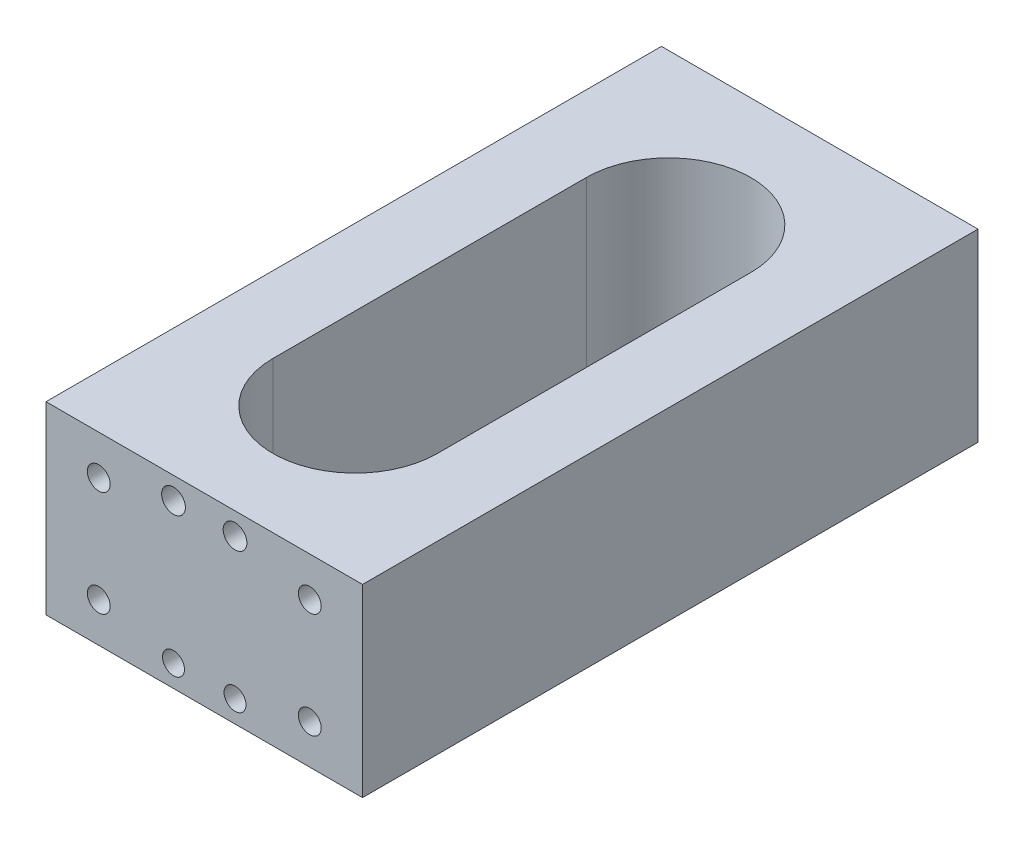
ISO-10303-21;
HEADER;
FILE_DESCRIPTION(('STEP AP214'),'2;1');
FILE_NAME('part.step','',(''),(''),'','','');
FILE_SCHEMA(('AUTOMOTIVE_DESIGN { 1 0 10303 214 1 1 1 1 }'));
ENDSEC;
DATA;
#1=APPLICATION_CONTEXT('core data for automotive mechanical design processes');
#2=APPLICATION_PROTOCOL_DEFINITION('international standard','automotive_design',2000,#1);
#3=PRODUCT_CONTEXT('',#1,'mechanical');
#4=PRODUCT('Part','Part','',(#3));
#5=PRODUCT_RELATED_PRODUCT_CATEGORY('part','',(#4));
#6=PRODUCT_DEFINITION_FORMATION('','',#4);
#7=PRODUCT_DEFINITION_CONTEXT('part definition',#1,'design');
#8=PRODUCT_DEFINITION('design','',#6,#7);
#9=PRODUCT_DEFINITION_SHAPE('','',#8);
#10=(LENGTH_UNIT() NAMED_UNIT(*) SI_UNIT(.MILLI.,.METRE.));
#11=(NAMED_UNIT(*) PLANE_ANGLE_UNIT() SI_UNIT($,.RADIAN.));
#12=(NAMED_UNIT(*) SI_UNIT($,.STERADIAN.) SOLID_ANGLE_UNIT());
#13=UNCERTAINTY_MEASURE_WITH_UNIT(LENGTH_MEASURE(1.E-05),#10,'distance_accuracy_value','');
#14=(GEOMETRIC_REPRESENTATION_CONTEXT(3) GLOBAL_UNCERTAINTY_ASSIGNED_CONTEXT((#13)) GLOBAL_UNIT_ASSIGNED_CONTEXT((#10,
#11,#12)) REPRESENTATION_CONTEXT('',''));
#15=CARTESIAN_POINT('',(0.,0.,0.));
#16=DIRECTION('',(0.,0.,1.));
#17=DIRECTION('',(1.,0.,0.));
#18=AXIS2_PLACEMENT_3D('',#15,#16,#17);
#19=CARTESIAN_POINT('',(0.,0.,0.));
#20=DIRECTION('',(0.,0.,1.));
#21=DIRECTION('',(1.,0.,0.));
#22=AXIS2_PLACEMENT_3D('',#19,#20,#21);
#23=PLANE('',#22);
#24=CARTESIAN_POINT('',(-3.5,-7.99999999999999,0.));
#25=DIRECTION('',(0.,0.,-1.));
#26=DIRECTION('',(-1.,0.,0.));
#27=AXIS2_PLACEMENT_3D('',#24,#25,#26);
#28=CIRCLE('',#27,1.25);
#29=CARTESIAN_POINT('',(-4.75,-7.99999999999999,0.));
#30=VERTEX_POINT('',#29);
#31=EDGE_CURVE('E194',#30,#30,#28,.T.);
#32=ORIENTED_EDGE('',*,*,#31,.F.);
#33=EDGE_LOOP('',(#32));
#34=FACE_BOUND('',#33,.T.);
#35=CARTESIAN_POINT('',(-12.,-5.99999999999999,0.));
#36=DIRECTION('',(0.,0.,1.));
#37=DIRECTION('',(1.,0.,0.));
#38=AXIS2_PLACEMENT_3D('',#35,#36,#37);
#39=CIRCLE('',#38,1.3);
#40=CARTESIAN_POINT('',(-10.7,-5.99999999999999,0.));
#41=VERTEX_POINT('',#40);
#42=EDGE_CURVE('E200',#41,#41,#39,.F.);
#43=ORIENTED_EDGE('',*,*,#42,.F.);
#44=EDGE_LOOP('',(#43));
#45=FACE_BOUND('',#44,.T.);
#46=CARTESIAN_POINT('',(-12.,6.,0.));
#47=DIRECTION('',(0.,0.,1.));
#48=DIRECTION('',(1.,0.,0.));
#49=AXIS2_PLACEMENT_3D('',#46,#47,#48);
#50=CIRCLE('',#49,1.3);
#51=CARTESIAN_POINT('',(-10.7,6.,0.));
#52=VERTEX_POINT('',#51);
#53=EDGE_CURVE('E206',#52,#52,#50,.F.);
#54=ORIENTED_EDGE('',*,*,#53,.F.);
#55=EDGE_LOOP('',(#54));
#56=FACE_BOUND('',#55,.T.);
#57=CARTESIAN_POINT('',(-3.5,8.,0.));
#58=DIRECTION('',(0.,0.,1.));
#59=DIRECTION('',(1.,0.,0.));
#60=AXIS2_PLACEMENT_3D('',#57,#58,#59);
#61=CIRCLE('',#60,1.35000000008995);
#62=CARTESIAN_POINT('',(-2.14999999991005,8.,0.));
#63=VERTEX_POINT('',#62);
#64=EDGE_CURVE('E212',#63,#63,#61,.F.);
#65=ORIENTED_EDGE('',*,*,#64,.F.);
#66=EDGE_LOOP('',(#65));
#67=FACE_BOUND('',#66,.T.);
#68=DIRECTION('',(0.,1.,0.));
#69=VECTOR('',#68,1.);
#70=CARTESIAN_POINT('',(-18.,0.,0.));
#71=LINE('',#70,#69);
#72=CARTESIAN_POINT('',(-18.,-10.5,0.));
#73=VERTEX_POINT('',#72);
#74=CARTESIAN_POINT('',(-18.,10.5,0.));
#75=VERTEX_POINT('',#74);
#76=EDGE_CURVE('E227',#73,#75,#71,.T.);
#77=ORIENTED_EDGE('',*,*,#76,.T.);
#78=DIRECTION('',(-1.,0.,0.));
#79=VECTOR('',#78,1.);
#80=CARTESIAN_POINT('',(0.,10.5,0.));
#81=LINE('',#80,#79);
#82=CARTESIAN_POINT('',(18.,10.5,0.));
#83=VERTEX_POINT('',#82);
#84=EDGE_CURVE('E234',#83,#75,#81,.T.);
#85=ORIENTED_EDGE('',*,*,#84,.F.);
#86=DIRECTION('',(0.,1.,0.));
#87=VECTOR('',#86,1.);
#88=CARTESIAN_POINT('',(18.,0.,0.));
#89=LINE('',#88,#87);
#90=CARTESIAN_POINT('',(18.,-10.5,0.));
#91=VERTEX_POINT('',#90);
#92=EDGE_CURVE('E247',#91,#83,#89,.T.);
#93=ORIENTED_EDGE('',*,*,#92,.F.);
#94=DIRECTION('',(-1.,0.,0.));
#95=VECTOR('',#94,1.);
#96=CARTESIAN_POINT('',(0.,-10.5,0.));
#97=LINE('',#96,#95);
#98=EDGE_CURVE('E244',#91,#73,#97,.T.);
#99=ORIENTED_EDGE('',*,*,#98,.T.);
#100=EDGE_LOOP('',(#77,#85,#93,#99));
#101=FACE_BOUND('',#100,.T.);
#102=CARTESIAN_POINT('',(12.,6.,0.));
#103=DIRECTION('',(0.,0.,1.));
#104=DIRECTION('',(1.,0.,0.));
#105=AXIS2_PLACEMENT_3D('',#102,#103,#104);
#106=CIRCLE('',#105,1.3);
#107=CARTESIAN_POINT('',(13.3,6.,0.));
#108=VERTEX_POINT('',#107);
#109=EDGE_CURVE('E221',#108,#108,#106,.T.);
#110=ORIENTED_EDGE('',*,*,#109,.T.);
#111=EDGE_LOOP('',(#110));
#112=FACE_BOUND('',#111,.T.);
#113=CARTESIAN_POINT('',(3.5,8.,0.));
#114=DIRECTION('',(0.,0.,1.));
#115=DIRECTION('',(1.,0.,0.));
#116=AXIS2_PLACEMENT_3D('',#113,#114,#115);
#117=CIRCLE('',#116,1.35000000008995);
#118=CARTESIAN_POINT('',(4.85000000008995,8.,0.));
#119=VERTEX_POINT('',#118);
#120=EDGE_CURVE('E218',#119,#119,#117,.T.);
#121=ORIENTED_EDGE('',*,*,#120,.T.);
#122=EDGE_LOOP('',(#121));
#123=FACE_BOUND('',#122,.T.);
#124=CARTESIAN_POINT('',(3.5,-8.,0.));
#125=DIRECTION('',(0.,0.,1.));
#126=DIRECTION('',(1.,0.,0.));
#127=AXIS2_PLACEMENT_3D('',#124,#125,#126);
#128=CIRCLE('',#127,1.25);
#129=CARTESIAN_POINT('',(4.75,-8.,0.));
#130=VERTEX_POINT('',#129);
#131=EDGE_CURVE('E188',#130,#130,#128,.T.);
#132=ORIENTED_EDGE('',*,*,#131,.T.);
#133=EDGE_LOOP('',(#132));
#134=FACE_BOUND('',#133,.T.);
#135=CARTESIAN_POINT('',(12.,-6.,0.));
#136=DIRECTION('',(0.,0.,1.));
#137=DIRECTION('',(1.,0.,0.));
#138=AXIS2_PLACEMENT_3D('',#135,#136,#137);
#139=CIRCLE('',#138,1.3);
#140=CARTESIAN_POINT('',(13.3,-6.,0.));
#141=VERTEX_POINT('',#140);
#142=EDGE_CURVE('E182',#141,#141,#139,.T.);
#143=ORIENTED_EDGE('',*,*,#142,.T.);
#144=EDGE_LOOP('',(#143));
#145=FACE_BOUND('',#144,.T.);
#146=ADVANCED_FACE('F34',(#34,#45,#56,#67,#101,#112,#123,#134,#145),#23,.F.);
#147=CARTESIAN_POINT('',(-18.,0.,70.));
#148=DIRECTION('',(-1.,0.,0.));
#149=DIRECTION('',(0.,0.,1.));
#150=AXIS2_PLACEMENT_3D('',#147,#148,#149);
#151=PLANE('',#150);
#152=ORIENTED_EDGE('',*,*,#76,.F.);
#153=DIRECTION('',(0.,0.,-1.));
#154=VECTOR('',#153,1.);
#155=CARTESIAN_POINT('',(-18.,-10.5,70.));
#156=LINE('',#155,#154);
#157=CARTESIAN_POINT('',(-18.,-10.5,70.));
#158=VERTEX_POINT('',#157);
#159=EDGE_CURVE('E11',#158,#73,#156,.T.);
#160=ORIENTED_EDGE('',*,*,#159,.F.);
#161=DIRECTION('',(0.,1.,0.));
#162=VECTOR('',#161,1.);
#163=CARTESIAN_POINT('',(-18.,0.,70.));
#164=LINE('',#163,#162);
#165=CARTESIAN_POINT('',(-18.,10.5,70.));
#166=VERTEX_POINT('',#165);
#167=EDGE_CURVE('E230',#158,#166,#164,.T.);
#168=ORIENTED_EDGE('',*,*,#167,.T.);
#169=DIRECTION('',(0.,0.,-1.));
#170=VECTOR('',#169,1.);
#171=CARTESIAN_POINT('',(-18.,10.5,70.));
#172=LINE('',#171,#170);
#173=EDGE_CURVE('E241',#166,#75,#172,.T.);
#174=ORIENTED_EDGE('',*,*,#173,.T.);
#175=EDGE_LOOP('',(#152,#160,#168,#174));
#176=FACE_BOUND('',#175,.T.);
#177=ADVANCED_FACE('F36',(#176),#151,.T.);
#178=CARTESIAN_POINT('',(0.,-10.5,70.));
#179=DIRECTION('',(0.,-1.,0.));
#180=DIRECTION('',(0.,0.,-1.));
#181=AXIS2_PLACEMENT_3D('',#178,#179,#180);
#182=PLANE('',#181);
#183=CARTESIAN_POINT('',(0.,-10.5,17.1932684601259));
#184=DIRECTION('',(0.,-1.,0.));
#185=DIRECTION('',(0.,0.,-1.));
#186=AXIS2_PLACEMENT_3D('',#183,#184,#185);
#187=CIRCLE('',#186,9.35706048924345);
#188=CARTESIAN_POINT('',(-9.35706048924346,-10.5,17.1932684601259));
#189=VERTEX_POINT('',#188);
#190=CARTESIAN_POINT('',(9.35706048924344,-10.5,17.1932684601259));
#191=VERTEX_POINT('',#190);
#192=EDGE_CURVE('E131',#189,#191,#187,.T.);
#193=ORIENTED_EDGE('',*,*,#192,.F.);
#194=DIRECTION('',(0.,0.,-1.));
#195=VECTOR('',#194,1.);
#196=CARTESIAN_POINT('',(-9.35706048924346,-10.5,70.));
#197=LINE('',#196,#195);
#198=CARTESIAN_POINT('',(-9.35706048924346,-10.5,52.8416943390084));
#199=VERTEX_POINT('',#198);
#200=EDGE_CURVE('E124',#199,#189,#197,.T.);
#201=ORIENTED_EDGE('',*,*,#200,.F.);
#202=CARTESIAN_POINT('',(0.,-10.5,52.8416943390084));
#203=DIRECTION('',(0.,-1.,0.));
#204=DIRECTION('',(0.,0.,-1.));
#205=AXIS2_PLACEMENT_3D('',#202,#203,#204);
#206=CIRCLE('',#205,9.35706048924345);
#207=CARTESIAN_POINT('',(9.35706048924344,-10.5,52.8416943390084));
#208=VERTEX_POINT('',#207);
#209=EDGE_CURVE('E104',#208,#199,#206,.T.);
#210=ORIENTED_EDGE('',*,*,#209,.F.);
#211=DIRECTION('',(0.,0.,1.));
#212=VECTOR('',#211,1.);
#213=CARTESIAN_POINT('',(9.35706048924344,-10.5,70.));
#214=LINE('',#213,#212);
#215=EDGE_CURVE('E129',#191,#208,#214,.T.);
#216=ORIENTED_EDGE('',*,*,#215,.F.);
#217=EDGE_LOOP('',(#193,#201,#210,#216));
#218=FACE_BOUND('',#217,.T.);
#219=ORIENTED_EDGE('',*,*,#98,.F.);
#220=DIRECTION('',(0.,0.,-1.));
#221=VECTOR('',#220,1.);
#222=CARTESIAN_POINT('',(18.,-10.5,70.));
#223=LINE('',#222,#221);
#224=CARTESIAN_POINT('',(18.,-10.5,70.));
#225=VERTEX_POINT('',#224);
#226=EDGE_CURVE('E42',#225,#91,#223,.T.);
#227=ORIENTED_EDGE('',*,*,#226,.F.);
#228=DIRECTION('',(-1.,0.,0.));
#229=VECTOR('',#228,1.);
#230=CARTESIAN_POINT('',(0.,-10.5,70.));
#231=LINE('',#230,#229);
#232=EDGE_CURVE('E233',#225,#158,#231,.T.);
#233=ORIENTED_EDGE('',*,*,#232,.T.);
#234=ORIENTED_EDGE('',*,*,#159,.T.);
#235=EDGE_LOOP('',(#219,#227,#233,#234));
#236=FACE_BOUND('',#235,.T.);
#237=ADVANCED_FACE('F265',(#218,#236),#182,.T.);
#238=CARTESIAN_POINT('',(18.,0.,70.));
#239=DIRECTION('',(-1.,0.,0.));
#240=DIRECTION('',(0.,0.,1.));
#241=AXIS2_PLACEMENT_3D('',#238,#239,#240);
#242=PLANE('',#241);
#243=ORIENTED_EDGE('',*,*,#92,.T.);
#244=DIRECTION('',(0.,0.,-1.));
#245=VECTOR('',#244,1.);
#246=CARTESIAN_POINT('',(18.,10.5,70.));
#247=LINE('',#246,#245);
#248=CARTESIAN_POINT('',(18.,10.5,70.));
#249=VERTEX_POINT('',#248);
#250=EDGE_CURVE('E252',#249,#83,#247,.T.);
#251=ORIENTED_EDGE('',*,*,#250,.F.);
#252=DIRECTION('',(0.,1.,0.));
#253=VECTOR('',#252,1.);
#254=CARTESIAN_POINT('',(18.,0.,70.));
#255=LINE('',#254,#253);
#256=EDGE_CURVE('E237',#225,#249,#255,.T.);
#257=ORIENTED_EDGE('',*,*,#256,.F.);
#258=ORIENTED_EDGE('',*,*,#226,.T.);
#259=EDGE_LOOP('',(#243,#251,#257,#258));
#260=FACE_BOUND('',#259,.T.);
#261=ADVANCED_FACE('F257',(#260),#242,.F.);
#262=CARTESIAN_POINT('',(0.,10.5,70.));
#263=DIRECTION('',(0.,-1.,0.));
#264=DIRECTION('',(0.,0.,-1.));
#265=AXIS2_PLACEMENT_3D('',#262,#263,#264);
#266=PLANE('',#265);
#267=DIRECTION('',(0.,0.,1.));
#268=VECTOR('',#267,1.);
#269=CARTESIAN_POINT('',(-9.35706048924346,10.5,17.1932684601259));
#270=LINE('',#269,#268);
#271=CARTESIAN_POINT('',(-9.35706048924346,10.5,17.1932684601259));
#272=VERTEX_POINT('',#271);
#273=CARTESIAN_POINT('',(-9.35706048924346,10.5,52.8416943390084));
#274=VERTEX_POINT('',#273);
#275=EDGE_CURVE('E110',#272,#274,#270,.T.);
#276=ORIENTED_EDGE('',*,*,#275,.F.);
#277=CARTESIAN_POINT('',(0.,10.5,17.1932684601259));
#278=DIRECTION('',(0.,1.,0.));
#279=DIRECTION('',(0.,0.,1.));
#280=AXIS2_PLACEMENT_3D('',#277,#278,#279);
#281=CIRCLE('',#280,9.35706048924345);
#282=CARTESIAN_POINT('',(9.35706048924344,10.5,17.1932684601259));
#283=VERTEX_POINT('',#282);
#284=EDGE_CURVE('E57',#283,#272,#281,.T.);
#285=ORIENTED_EDGE('',*,*,#284,.F.);
#286=DIRECTION('',(0.,0.,-1.));
#287=VECTOR('',#286,1.);
#288=CARTESIAN_POINT('',(9.35706048924344,10.5,17.1932684601259));
#289=LINE('',#288,#287);
#290=CARTESIAN_POINT('',(9.35706048924344,10.5,52.8416943390084));
#291=VERTEX_POINT('',#290);
#292=EDGE_CURVE('E117',#291,#283,#289,.T.);
#293=ORIENTED_EDGE('',*,*,#292,.F.);
#294=CARTESIAN_POINT('',(0.,10.5,52.8416943390084));
#295=DIRECTION('',(0.,1.,0.));
#296=DIRECTION('',(0.,0.,1.));
#297=AXIS2_PLACEMENT_3D('',#294,#295,#296);
#298=CIRCLE('',#297,9.35706048924345);
#299=EDGE_CURVE('E101',#274,#291,#298,.T.);
#300=ORIENTED_EDGE('',*,*,#299,.F.);
#301=EDGE_LOOP('',(#276,#285,#293,#300));
#302=FACE_BOUND('',#301,.T.);
#303=ORIENTED_EDGE('',*,*,#84,.T.);
#304=ORIENTED_EDGE('',*,*,#173,.F.);
#305=DIRECTION('',(-1.,0.,0.));
#306=VECTOR('',#305,1.);
#307=CARTESIAN_POINT('',(0.,10.5,70.));
#308=LINE('',#307,#306);
#309=EDGE_CURVE('E239',#249,#166,#308,.T.);
#310=ORIENTED_EDGE('',*,*,#309,.F.);
#311=ORIENTED_EDGE('',*,*,#250,.T.);
#312=EDGE_LOOP('',(#303,#304,#310,#311));
#313=FACE_BOUND('',#312,.T.);
#314=ADVANCED_FACE('F114',(#302,#313),#266,.F.);
#315=CARTESIAN_POINT('',(0.,0.,70.));
#316=DIRECTION('',(0.,0.,1.));
#317=DIRECTION('',(1.,0.,0.));
#318=AXIS2_PLACEMENT_3D('',#315,#316,#317);
#319=PLANE('',#318);
#320=CARTESIAN_POINT('',(12.,-6.,70.));
#321=DIRECTION('',(0.,0.,1.));
#322=DIRECTION('',(1.,0.,0.));
#323=AXIS2_PLACEMENT_3D('',#320,#321,#322);
#324=CIRCLE('',#323,1.3);
#325=CARTESIAN_POINT('',(13.3,-6.,70.));
#326=VERTEX_POINT('',#325);
#327=EDGE_CURVE('E133',#326,#326,#324,.T.);
#328=ORIENTED_EDGE('',*,*,#327,.F.);
#329=EDGE_LOOP('',(#328));
#330=FACE_BOUND('',#329,.T.);
#331=CARTESIAN_POINT('',(3.5,-8.,70.));
#332=DIRECTION('',(0.,0.,1.));
#333=DIRECTION('',(1.,0.,0.));
#334=AXIS2_PLACEMENT_3D('',#331,#332,#333);
#335=CIRCLE('',#334,1.25);
#336=CARTESIAN_POINT('',(4.75,-8.,70.));
#337=VERTEX_POINT('',#336);
#338=EDGE_CURVE('E137',#337,#337,#335,.T.);
#339=ORIENTED_EDGE('',*,*,#338,.F.);
#340=EDGE_LOOP('',(#339));
#341=FACE_BOUND('',#340,.T.);
#342=CARTESIAN_POINT('',(-3.5,-7.99999999999999,70.));
#343=DIRECTION('',(0.,0.,1.));
#344=DIRECTION('',(1.,0.,0.));
#345=AXIS2_PLACEMENT_3D('',#342,#343,#344);
#346=CIRCLE('',#345,1.25);
#347=CARTESIAN_POINT('',(-2.25,-7.99999999999999,70.));
#348=VERTEX_POINT('',#347);
#349=EDGE_CURVE('E143',#348,#348,#346,.T.);
#350=ORIENTED_EDGE('',*,*,#349,.F.);
#351=EDGE_LOOP('',(#350));
#352=FACE_BOUND('',#351,.T.);
#353=CARTESIAN_POINT('',(-12.,-5.99999999999999,70.));
#354=DIRECTION('',(0.,0.,1.));
#355=DIRECTION('',(1.,0.,0.));
#356=AXIS2_PLACEMENT_3D('',#353,#354,#355);
#357=CIRCLE('',#356,1.3);
#358=CARTESIAN_POINT('',(-10.7,-5.99999999999999,70.));
#359=VERTEX_POINT('',#358);
#360=EDGE_CURVE('E149',#359,#359,#357,.T.);
#361=ORIENTED_EDGE('',*,*,#360,.F.);
#362=EDGE_LOOP('',(#361));
#363=FACE_BOUND('',#362,.T.);
#364=CARTESIAN_POINT('',(-12.,6.,70.));
#365=DIRECTION('',(0.,0.,1.));
#366=DIRECTION('',(1.,0.,0.));
#367=AXIS2_PLACEMENT_3D('',#364,#365,#366);
#368=CIRCLE('',#367,1.3);
#369=CARTESIAN_POINT('',(-10.7,6.,70.));
#370=VERTEX_POINT('',#369);
#371=EDGE_CURVE('E155',#370,#370,#368,.T.);
#372=ORIENTED_EDGE('',*,*,#371,.F.);
#373=EDGE_LOOP('',(#372));
#374=FACE_BOUND('',#373,.T.);
#375=CARTESIAN_POINT('',(-3.5,8.,70.));
#376=DIRECTION('',(0.,0.,1.));
#377=DIRECTION('',(1.,0.,0.));
#378=AXIS2_PLACEMENT_3D('',#375,#376,#377);
#379=CIRCLE('',#378,1.35000000008995);
#380=CARTESIAN_POINT('',(-2.14999999991005,8.,70.));
#381=VERTEX_POINT('',#380);
#382=EDGE_CURVE('E161',#381,#381,#379,.T.);
#383=ORIENTED_EDGE('',*,*,#382,.F.);
#384=EDGE_LOOP('',(#383));
#385=FACE_BOUND('',#384,.T.);
#386=CARTESIAN_POINT('',(12.,6.,70.));
#387=DIRECTION('',(0.,0.,1.));
#388=DIRECTION('',(1.,0.,0.));
#389=AXIS2_PLACEMENT_3D('',#386,#387,#388);
#390=CIRCLE('',#389,1.3);
#391=CARTESIAN_POINT('',(13.3,6.,70.));
#392=VERTEX_POINT('',#391);
#393=EDGE_CURVE('E167',#392,#392,#390,.T.);
#394=ORIENTED_EDGE('',*,*,#393,.F.);
#395=EDGE_LOOP('',(#394));
#396=FACE_BOUND('',#395,.T.);
#397=CARTESIAN_POINT('',(3.5,8.,70.));
#398=DIRECTION('',(0.,0.,1.));
#399=DIRECTION('',(1.,0.,0.));
#400=AXIS2_PLACEMENT_3D('',#397,#398,#399);
#401=CIRCLE('',#400,1.35000000008995);
#402=CARTESIAN_POINT('',(4.85000000008995,8.,70.));
#403=VERTEX_POINT('',#402);
#404=EDGE_CURVE('E173',#403,#403,#401,.T.);
#405=ORIENTED_EDGE('',*,*,#404,.F.);
#406=EDGE_LOOP('',(#405));
#407=FACE_BOUND('',#406,.T.);
#408=ORIENTED_EDGE('',*,*,#167,.F.);
#409=ORIENTED_EDGE('',*,*,#232,.F.);
#410=ORIENTED_EDGE('',*,*,#256,.T.);
#411=ORIENTED_EDGE('',*,*,#309,.T.);
#412=EDGE_LOOP('',(#408,#409,#410,#411));
#413=FACE_BOUND('',#412,.T.);
#414=ADVANCED_FACE('F272',(#330,#341,#352,#363,#374,#385,#396,#407,#413),#319,.T.);
#415=CARTESIAN_POINT('',(12.,6.,4.));
#416=DIRECTION('',(0.,0.,-1.));
#417=DIRECTION('',(-1.,0.,0.));
#418=AXIS2_PLACEMENT_3D('',#415,#416,#417);
#419=CYLINDRICAL_SURFACE('',#418,1.3);
#420=CARTESIAN_POINT('',(12.,6.,4.));
#421=DIRECTION('',(0.,0.,1.));
#422=DIRECTION('',(1.,0.,0.));
#423=AXIS2_PLACEMENT_3D('',#420,#421,#422);
#424=CIRCLE('',#423,1.3);
#425=CARTESIAN_POINT('',(13.3,6.,4.));
#426=VERTEX_POINT('',#425);
#427=EDGE_CURVE('E224',#426,#426,#424,.T.);
#428=ORIENTED_EDGE('',*,*,#427,.T.);
#429=EDGE_LOOP('',(#428));
#430=FACE_BOUND('',#429,.T.);
#431=ORIENTED_EDGE('',*,*,#109,.F.);
#432=EDGE_LOOP('',(#431));
#433=FACE_BOUND('',#432,.T.);
#434=ADVANCED_FACE('F274',(#430,#433),#419,.F.);
#435=CARTESIAN_POINT('',(0.,0.,4.));
#436=DIRECTION('',(0.,0.,1.));
#437=DIRECTION('',(1.,0.,0.));
#438=AXIS2_PLACEMENT_3D('',#435,#436,#437);
#439=PLANE('',#438);
#440=ORIENTED_EDGE('',*,*,#427,.F.);
#441=EDGE_LOOP('',(#440));
#442=FACE_BOUND('',#441,.T.);
#443=ADVANCED_FACE('F281',(#442),#439,.F.);
#444=CARTESIAN_POINT('',(3.5,8.,4.));
#445=DIRECTION('',(0.,0.,-1.));
#446=DIRECTION('',(-1.,0.,0.));
#447=AXIS2_PLACEMENT_3D('',#444,#445,#446);
#448=CYLINDRICAL_SURFACE('',#447,1.35000000008995);
#449=CARTESIAN_POINT('',(3.5,8.,4.));
#450=DIRECTION('',(0.,0.,1.));
#451=DIRECTION('',(1.,0.,0.));
#452=AXIS2_PLACEMENT_3D('',#449,#450,#451);
#453=CIRCLE('',#452,1.35000000008995);
#454=CARTESIAN_POINT('',(4.85000000008995,8.,4.));
#455=VERTEX_POINT('',#454);
#456=EDGE_CURVE('E215',#455,#455,#453,.T.);
#457=ORIENTED_EDGE('',*,*,#456,.T.);
#458=EDGE_LOOP('',(#457));
#459=FACE_BOUND('',#458,.T.);
#460=ORIENTED_EDGE('',*,*,#120,.F.);
#461=EDGE_LOOP('',(#460));
#462=FACE_BOUND('',#461,.T.);
#463=ADVANCED_FACE('F431',(#459,#462),#448,.F.);
#464=CARTESIAN_POINT('',(0.,0.,4.));
#465=DIRECTION('',(0.,0.,1.));
#466=DIRECTION('',(1.,0.,0.));
#467=AXIS2_PLACEMENT_3D('',#464,#465,#466);
#468=PLANE('',#467);
#469=ORIENTED_EDGE('',*,*,#456,.F.);
#470=EDGE_LOOP('',(#469));
#471=FACE_BOUND('',#470,.T.);
#472=ADVANCED_FACE('F426',(#471),#468,.F.);
#473=CARTESIAN_POINT('',(-3.5,8.,4.));
#474=DIRECTION('',(0.,0.,-1.));
#475=DIRECTION('',(-1.,0.,0.));
#476=AXIS2_PLACEMENT_3D('',#473,#474,#475);
#477=CYLINDRICAL_SURFACE('',#476,1.35000000008995);
#478=CARTESIAN_POINT('',(-3.5,8.,4.));
#479=DIRECTION('',(0.,0.,1.));
#480=DIRECTION('',(1.,0.,0.));
#481=AXIS2_PLACEMENT_3D('',#478,#479,#480);
#482=CIRCLE('',#481,1.35000000008995);
#483=CARTESIAN_POINT('',(-2.14999999991005,8.,4.));
#484=VERTEX_POINT('',#483);
#485=EDGE_CURVE('E209',#484,#484,#482,.F.);
#486=ORIENTED_EDGE('',*,*,#485,.F.);
#487=EDGE_LOOP('',(#486));
#488=FACE_BOUND('',#487,.T.);
#489=ORIENTED_EDGE('',*,*,#64,.T.);
#490=EDGE_LOOP('',(#489));
#491=FACE_BOUND('',#490,.T.);
#492=ADVANCED_FACE('F423',(#488,#491),#477,.F.);
#493=CARTESIAN_POINT('',(0.,0.,4.));
#494=DIRECTION('',(0.,0.,1.));
#495=DIRECTION('',(1.,0.,0.));
#496=AXIS2_PLACEMENT_3D('',#493,#494,#495);
#497=PLANE('',#496);
#498=ORIENTED_EDGE('',*,*,#485,.T.);
#499=EDGE_LOOP('',(#498));
#500=FACE_BOUND('',#499,.T.);
#501=ADVANCED_FACE('F418',(#500),#497,.F.);
#502=CARTESIAN_POINT('',(-12.,6.,4.));
#503=DIRECTION('',(0.,0.,-1.));
#504=DIRECTION('',(-1.,0.,0.));
#505=AXIS2_PLACEMENT_3D('',#502,#503,#504);
#506=CYLINDRICAL_SURFACE('',#505,1.3);
#507=CARTESIAN_POINT('',(-12.,6.,4.));
#508=DIRECTION('',(0.,0.,1.));
#509=DIRECTION('',(1.,0.,0.));
#510=AXIS2_PLACEMENT_3D('',#507,#508,#509);
#511=CIRCLE('',#510,1.3);
#512=CARTESIAN_POINT('',(-10.7,6.,4.));
#513=VERTEX_POINT('',#512);
#514=EDGE_CURVE('E203',#513,#513,#511,.F.);
#515=ORIENTED_EDGE('',*,*,#514,.F.);
#516=EDGE_LOOP('',(#515));
#517=FACE_BOUND('',#516,.T.);
#518=ORIENTED_EDGE('',*,*,#53,.T.);
#519=EDGE_LOOP('',(#518));
#520=FACE_BOUND('',#519,.T.);
#521=ADVANCED_FACE('F415',(#517,#520),#506,.F.);
#522=CARTESIAN_POINT('',(0.,0.,4.));
#523=DIRECTION('',(0.,0.,1.));
#524=DIRECTION('',(1.,0.,0.));
#525=AXIS2_PLACEMENT_3D('',#522,#523,#524);
#526=PLANE('',#525);
#527=ORIENTED_EDGE('',*,*,#514,.T.);
#528=EDGE_LOOP('',(#527));
#529=FACE_BOUND('',#528,.T.);
#530=ADVANCED_FACE('F410',(#529),#526,.F.);
#531=CARTESIAN_POINT('',(-12.,-5.99999999999999,4.));
#532=DIRECTION('',(0.,0.,-1.));
#533=DIRECTION('',(-1.,0.,0.));
#534=AXIS2_PLACEMENT_3D('',#531,#532,#533);
#535=CYLINDRICAL_SURFACE('',#534,1.3);
#536=CARTESIAN_POINT('',(-12.,-5.99999999999999,4.));
#537=DIRECTION('',(0.,0.,1.));
#538=DIRECTION('',(1.,0.,0.));
#539=AXIS2_PLACEMENT_3D('',#536,#537,#538);
#540=CIRCLE('',#539,1.3);
#541=CARTESIAN_POINT('',(-10.7,-5.99999999999999,4.));
#542=VERTEX_POINT('',#541);
#543=EDGE_CURVE('E197',#542,#542,#540,.F.);
#544=ORIENTED_EDGE('',*,*,#543,.F.);
#545=EDGE_LOOP('',(#544));
#546=FACE_BOUND('',#545,.T.);
#547=ORIENTED_EDGE('',*,*,#42,.T.);
#548=EDGE_LOOP('',(#547));
#549=FACE_BOUND('',#548,.T.);
#550=ADVANCED_FACE('F407',(#546,#549),#535,.F.);
#551=CARTESIAN_POINT('',(0.,0.,4.));
#552=DIRECTION('',(0.,0.,1.));
#553=DIRECTION('',(1.,0.,0.));
#554=AXIS2_PLACEMENT_3D('',#551,#552,#553);
#555=PLANE('',#554);
#556=ORIENTED_EDGE('',*,*,#543,.T.);
#557=EDGE_LOOP('',(#556));
#558=FACE_BOUND('',#557,.T.);
#559=ADVANCED_FACE('F402',(#558),#555,.F.);
#560=CARTESIAN_POINT('',(-3.5,-7.99999999999999,4.));
#561=DIRECTION('',(0.,0.,-1.));
#562=DIRECTION('',(-1.,0.,0.));
#563=AXIS2_PLACEMENT_3D('',#560,#561,#562);
#564=CYLINDRICAL_SURFACE('',#563,1.25);
#565=CARTESIAN_POINT('',(-3.5,-7.99999999999999,4.));
#566=DIRECTION('',(0.,0.,-1.));
#567=DIRECTION('',(-1.,0.,0.));
#568=AXIS2_PLACEMENT_3D('',#565,#566,#567);
#569=CIRCLE('',#568,1.25);
#570=CARTESIAN_POINT('',(-4.75,-7.99999999999999,4.));
#571=VERTEX_POINT('',#570);
#572=EDGE_CURVE('E191',#571,#571,#569,.T.);
#573=ORIENTED_EDGE('',*,*,#572,.F.);
#574=EDGE_LOOP('',(#573));
#575=FACE_BOUND('',#574,.T.);
#576=ORIENTED_EDGE('',*,*,#31,.T.);
#577=EDGE_LOOP('',(#576));
#578=FACE_BOUND('',#577,.T.);
#579=ADVANCED_FACE('F399',(#575,#578),#564,.F.);
#580=CARTESIAN_POINT('',(-3.5,-7.99999999999999,4.));
#581=DIRECTION('',(0.,0.,-1.));
#582=DIRECTION('',(-1.,0.,0.));
#583=AXIS2_PLACEMENT_3D('',#580,#581,#582);
#584=PLANE('',#583);
#585=ORIENTED_EDGE('',*,*,#572,.T.);
#586=EDGE_LOOP('',(#585));
#587=FACE_BOUND('',#586,.T.);
#588=ADVANCED_FACE('F394',(#587),#584,.T.);
#589=CARTESIAN_POINT('',(3.5,-8.,4.));
#590=DIRECTION('',(0.,0.,-1.));
#591=DIRECTION('',(-1.,0.,0.));
#592=AXIS2_PLACEMENT_3D('',#589,#590,#591);
#593=CYLINDRICAL_SURFACE('',#592,1.25);
#594=CARTESIAN_POINT('',(3.5,-8.,4.));
#595=DIRECTION('',(0.,0.,1.));
#596=DIRECTION('',(1.,0.,0.));
#597=AXIS2_PLACEMENT_3D('',#594,#595,#596);
#598=CIRCLE('',#597,1.25);
#599=CARTESIAN_POINT('',(4.75,-8.,4.));
#600=VERTEX_POINT('',#599);
#601=EDGE_CURVE('E185',#600,#600,#598,.T.);
#602=ORIENTED_EDGE('',*,*,#601,.T.);
#603=EDGE_LOOP('',(#602));
#604=FACE_BOUND('',#603,.T.);
#605=ORIENTED_EDGE('',*,*,#131,.F.);
#606=EDGE_LOOP('',(#605));
#607=FACE_BOUND('',#606,.T.);
#608=ADVANCED_FACE('F391',(#604,#607),#593,.F.);
#609=CARTESIAN_POINT('',(3.5,-8.,4.));
#610=DIRECTION('',(0.,0.,1.));
#611=DIRECTION('',(1.,0.,0.));
#612=AXIS2_PLACEMENT_3D('',#609,#610,#611);
#613=PLANE('',#612);
#614=ORIENTED_EDGE('',*,*,#601,.F.);
#615=EDGE_LOOP('',(#614));
#616=FACE_BOUND('',#615,.T.);
#617=ADVANCED_FACE('F386',(#616),#613,.F.);
#618=CARTESIAN_POINT('',(12.,-6.,4.));
#619=DIRECTION('',(0.,0.,-1.));
#620=DIRECTION('',(-1.,0.,0.));
#621=AXIS2_PLACEMENT_3D('',#618,#619,#620);
#622=CYLINDRICAL_SURFACE('',#621,1.3);
#623=CARTESIAN_POINT('',(12.,-6.,4.));
#624=DIRECTION('',(0.,0.,1.));
#625=DIRECTION('',(1.,0.,0.));
#626=AXIS2_PLACEMENT_3D('',#623,#624,#625);
#627=CIRCLE('',#626,1.3);
#628=CARTESIAN_POINT('',(13.3,-6.,4.));
#629=VERTEX_POINT('',#628);
#630=EDGE_CURVE('E179',#629,#629,#627,.T.);
#631=ORIENTED_EDGE('',*,*,#630,.T.);
#632=EDGE_LOOP('',(#631));
#633=FACE_BOUND('',#632,.T.);
#634=ORIENTED_EDGE('',*,*,#142,.F.);
#635=EDGE_LOOP('',(#634));
#636=FACE_BOUND('',#635,.T.);
#637=ADVANCED_FACE('F383',(#633,#636),#622,.F.);
#638=CARTESIAN_POINT('',(12.,-6.,4.));
#639=DIRECTION('',(0.,0.,1.));
#640=DIRECTION('',(1.,0.,0.));
#641=AXIS2_PLACEMENT_3D('',#638,#639,#640);
#642=PLANE('',#641);
#643=ORIENTED_EDGE('',*,*,#630,.F.);
#644=EDGE_LOOP('',(#643));
#645=FACE_BOUND('',#644,.T.);
#646=ADVANCED_FACE('F381',(#645),#642,.F.);
#647=CARTESIAN_POINT('',(3.5,8.,66.));
#648=DIRECTION('',(0.,0.,1.));
#649=DIRECTION('',(1.,0.,0.));
#650=AXIS2_PLACEMENT_3D('',#647,#648,#649);
#651=CYLINDRICAL_SURFACE('',#650,1.35000000008995);
#652=CARTESIAN_POINT('',(3.5,8.,66.));
#653=DIRECTION('',(0.,0.,1.));
#654=DIRECTION('',(1.,0.,0.));
#655=AXIS2_PLACEMENT_3D('',#652,#653,#654);
#656=CIRCLE('',#655,1.35000000008995);
#657=CARTESIAN_POINT('',(4.85000000008995,8.,66.));
#658=VERTEX_POINT('',#657);
#659=EDGE_CURVE('E176',#658,#658,#656,.T.);
#660=ORIENTED_EDGE('',*,*,#659,.F.);
#661=EDGE_LOOP('',(#660));
#662=FACE_BOUND('',#661,.T.);
#663=ORIENTED_EDGE('',*,*,#404,.T.);
#664=EDGE_LOOP('',(#663));
#665=FACE_BOUND('',#664,.T.);
#666=ADVANCED_FACE('F377',(#662,#665),#651,.F.);
#667=CARTESIAN_POINT('',(3.5,8.,66.));
#668=DIRECTION('',(0.,0.,1.));
#669=DIRECTION('',(1.,0.,0.));
#670=AXIS2_PLACEMENT_3D('',#667,#668,#669);
#671=PLANE('',#670);
#672=ORIENTED_EDGE('',*,*,#659,.T.);
#673=EDGE_LOOP('',(#672));
#674=FACE_BOUND('',#673,.T.);
#675=ADVANCED_FACE('F373',(#674),#671,.T.);
#676=CARTESIAN_POINT('',(12.,6.,66.));
#677=DIRECTION('',(0.,0.,1.));
#678=DIRECTION('',(1.,0.,0.));
#679=AXIS2_PLACEMENT_3D('',#676,#677,#678);
#680=CYLINDRICAL_SURFACE('',#679,1.3);
#681=CARTESIAN_POINT('',(12.,6.,66.));
#682=DIRECTION('',(0.,0.,1.));
#683=DIRECTION('',(1.,0.,0.));
#684=AXIS2_PLACEMENT_3D('',#681,#682,#683);
#685=CIRCLE('',#684,1.3);
#686=CARTESIAN_POINT('',(13.3,6.,66.));
#687=VERTEX_POINT('',#686);
#688=EDGE_CURVE('E170',#687,#687,#685,.T.);
#689=ORIENTED_EDGE('',*,*,#688,.F.);
#690=EDGE_LOOP('',(#689));
#691=FACE_BOUND('',#690,.T.);
#692=ORIENTED_EDGE('',*,*,#393,.T.);
#693=EDGE_LOOP('',(#692));
#694=FACE_BOUND('',#693,.T.);
#695=ADVANCED_FACE('F369',(#691,#694),#680,.F.);
#696=CARTESIAN_POINT('',(12.,6.,66.));
#697=DIRECTION('',(0.,0.,1.));
#698=DIRECTION('',(1.,0.,0.));
#699=AXIS2_PLACEMENT_3D('',#696,#697,#698);
#700=PLANE('',#699);
#701=ORIENTED_EDGE('',*,*,#688,.T.);
#702=EDGE_LOOP('',(#701));
#703=FACE_BOUND('',#702,.T.);
#704=ADVANCED_FACE('F365',(#703),#700,.T.);
#705=CARTESIAN_POINT('',(-3.5,8.,66.));
#706=DIRECTION('',(0.,0.,1.));
#707=DIRECTION('',(1.,0.,0.));
#708=AXIS2_PLACEMENT_3D('',#705,#706,#707);
#709=CYLINDRICAL_SURFACE('',#708,1.35000000008995);
#710=CARTESIAN_POINT('',(-3.5,8.,66.));
#711=DIRECTION('',(0.,0.,1.));
#712=DIRECTION('',(1.,0.,0.));
#713=AXIS2_PLACEMENT_3D('',#710,#711,#712);
#714=CIRCLE('',#713,1.35000000008995);
#715=CARTESIAN_POINT('',(-2.14999999991005,8.,66.));
#716=VERTEX_POINT('',#715);
#717=EDGE_CURVE('E164',#716,#716,#714,.T.);
#718=ORIENTED_EDGE('',*,*,#717,.F.);
#719=EDGE_LOOP('',(#718));
#720=FACE_BOUND('',#719,.T.);
#721=ORIENTED_EDGE('',*,*,#382,.T.);
#722=EDGE_LOOP('',(#721));
#723=FACE_BOUND('',#722,.T.);
#724=ADVANCED_FACE('F361',(#720,#723),#709,.F.);
#725=CARTESIAN_POINT('',(-3.5,8.,66.));
#726=DIRECTION('',(0.,0.,1.));
#727=DIRECTION('',(1.,0.,0.));
#728=AXIS2_PLACEMENT_3D('',#725,#726,#727);
#729=PLANE('',#728);
#730=ORIENTED_EDGE('',*,*,#717,.T.);
#731=EDGE_LOOP('',(#730));
#732=FACE_BOUND('',#731,.T.);
#733=ADVANCED_FACE('F357',(#732),#729,.T.);
#734=CARTESIAN_POINT('',(-12.,6.,66.));
#735=DIRECTION('',(0.,0.,1.));
#736=DIRECTION('',(1.,0.,0.));
#737=AXIS2_PLACEMENT_3D('',#734,#735,#736);
#738=CYLINDRICAL_SURFACE('',#737,1.3);
#739=CARTESIAN_POINT('',(-12.,6.,66.));
#740=DIRECTION('',(0.,0.,1.));
#741=DIRECTION('',(1.,0.,0.));
#742=AXIS2_PLACEMENT_3D('',#739,#740,#741);
#743=CIRCLE('',#742,1.3);
#744=CARTESIAN_POINT('',(-10.7,6.,66.));
#745=VERTEX_POINT('',#744);
#746=EDGE_CURVE('E158',#745,#745,#743,.T.);
#747=ORIENTED_EDGE('',*,*,#746,.F.);
#748=EDGE_LOOP('',(#747));
#749=FACE_BOUND('',#748,.T.);
#750=ORIENTED_EDGE('',*,*,#371,.T.);
#751=EDGE_LOOP('',(#750));
#752=FACE_BOUND('',#751,.T.);
#753=ADVANCED_FACE('F353',(#749,#752),#738,.F.);
#754=CARTESIAN_POINT('',(-12.,6.,66.));
#755=DIRECTION('',(0.,0.,1.));
#756=DIRECTION('',(1.,0.,0.));
#757=AXIS2_PLACEMENT_3D('',#754,#755,#756);
#758=PLANE('',#757);
#759=ORIENTED_EDGE('',*,*,#746,.T.);
#760=EDGE_LOOP('',(#759));
#761=FACE_BOUND('',#760,.T.);
#762=ADVANCED_FACE('F349',(#761),#758,.T.);
#763=CARTESIAN_POINT('',(-12.,-5.99999999999999,66.));
#764=DIRECTION('',(0.,0.,1.));
#765=DIRECTION('',(1.,0.,0.));
#766=AXIS2_PLACEMENT_3D('',#763,#764,#765);
#767=CYLINDRICAL_SURFACE('',#766,1.3);
#768=CARTESIAN_POINT('',(-12.,-5.99999999999999,66.));
#769=DIRECTION('',(0.,0.,1.));
#770=DIRECTION('',(1.,0.,0.));
#771=AXIS2_PLACEMENT_3D('',#768,#769,#770);
#772=CIRCLE('',#771,1.3);
#773=CARTESIAN_POINT('',(-10.7,-5.99999999999999,66.));
#774=VERTEX_POINT('',#773);
#775=EDGE_CURVE('E152',#774,#774,#772,.T.);
#776=ORIENTED_EDGE('',*,*,#775,.F.);
#777=EDGE_LOOP('',(#776));
#778=FACE_BOUND('',#777,.T.);
#779=ORIENTED_EDGE('',*,*,#360,.T.);
#780=EDGE_LOOP('',(#779));
#781=FACE_BOUND('',#780,.T.);
#782=ADVANCED_FACE('F345',(#778,#781),#767,.F.);
#783=CARTESIAN_POINT('',(-12.,-5.99999999999999,66.));
#784=DIRECTION('',(0.,0.,1.));
#785=DIRECTION('',(1.,0.,0.));
#786=AXIS2_PLACEMENT_3D('',#783,#784,#785);
#787=PLANE('',#786);
#788=ORIENTED_EDGE('',*,*,#775,.T.);
#789=EDGE_LOOP('',(#788));
#790=FACE_BOUND('',#789,.T.);
#791=ADVANCED_FACE('F341',(#790),#787,.T.);
#792=CARTESIAN_POINT('',(-3.5,-7.99999999999999,66.));
#793=DIRECTION('',(0.,0.,1.));
#794=DIRECTION('',(1.,0.,0.));
#795=AXIS2_PLACEMENT_3D('',#792,#793,#794);
#796=CYLINDRICAL_SURFACE('',#795,1.25);
#797=CARTESIAN_POINT('',(-3.5,-7.99999999999999,66.));
#798=DIRECTION('',(0.,0.,1.));
#799=DIRECTION('',(1.,0.,0.));
#800=AXIS2_PLACEMENT_3D('',#797,#798,#799);
#801=CIRCLE('',#800,1.25);
#802=CARTESIAN_POINT('',(-2.25,-7.99999999999999,66.));
#803=VERTEX_POINT('',#802);
#804=EDGE_CURVE('E146',#803,#803,#801,.T.);
#805=ORIENTED_EDGE('',*,*,#804,.F.);
#806=EDGE_LOOP('',(#805));
#807=FACE_BOUND('',#806,.T.);
#808=ORIENTED_EDGE('',*,*,#349,.T.);
#809=EDGE_LOOP('',(#808));
#810=FACE_BOUND('',#809,.T.);
#811=ADVANCED_FACE('F337',(#807,#810),#796,.F.);
#812=CARTESIAN_POINT('',(-3.5,-7.99999999999999,66.));
#813=DIRECTION('',(0.,0.,1.));
#814=DIRECTION('',(1.,0.,0.));
#815=AXIS2_PLACEMENT_3D('',#812,#813,#814);
#816=PLANE('',#815);
#817=ORIENTED_EDGE('',*,*,#804,.T.);
#818=EDGE_LOOP('',(#817));
#819=FACE_BOUND('',#818,.T.);
#820=ADVANCED_FACE('F333',(#819),#816,.T.);
#821=CARTESIAN_POINT('',(3.5,-8.,66.));
#822=DIRECTION('',(0.,0.,1.));
#823=DIRECTION('',(1.,0.,0.));
#824=AXIS2_PLACEMENT_3D('',#821,#822,#823);
#825=CYLINDRICAL_SURFACE('',#824,1.25);
#826=CARTESIAN_POINT('',(3.5,-8.,66.));
#827=DIRECTION('',(0.,0.,1.));
#828=DIRECTION('',(1.,0.,0.));
#829=AXIS2_PLACEMENT_3D('',#826,#827,#828);
#830=CIRCLE('',#829,1.25);
#831=CARTESIAN_POINT('',(4.75,-8.,66.));
#832=VERTEX_POINT('',#831);
#833=EDGE_CURVE('E140',#832,#832,#830,.T.);
#834=ORIENTED_EDGE('',*,*,#833,.F.);
#835=EDGE_LOOP('',(#834));
#836=FACE_BOUND('',#835,.T.);
#837=ORIENTED_EDGE('',*,*,#338,.T.);
#838=EDGE_LOOP('',(#837));
#839=FACE_BOUND('',#838,.T.);
#840=ADVANCED_FACE('F329',(#836,#839),#825,.F.);
#841=CARTESIAN_POINT('',(3.5,-8.,66.));
#842=DIRECTION('',(0.,0.,1.));
#843=DIRECTION('',(1.,0.,0.));
#844=AXIS2_PLACEMENT_3D('',#841,#842,#843);
#845=PLANE('',#844);
#846=ORIENTED_EDGE('',*,*,#833,.T.);
#847=EDGE_LOOP('',(#846));
#848=FACE_BOUND('',#847,.T.);
#849=ADVANCED_FACE('F325',(#848),#845,.T.);
#850=CARTESIAN_POINT('',(12.,-6.,66.));
#851=DIRECTION('',(0.,0.,1.));
#852=DIRECTION('',(1.,0.,0.));
#853=AXIS2_PLACEMENT_3D('',#850,#851,#852);
#854=CYLINDRICAL_SURFACE('',#853,1.3);
#855=CARTESIAN_POINT('',(12.,-6.,66.));
#856=DIRECTION('',(0.,0.,1.));
#857=DIRECTION('',(1.,0.,0.));
#858=AXIS2_PLACEMENT_3D('',#855,#856,#857);
#859=CIRCLE('',#858,1.3);
#860=CARTESIAN_POINT('',(13.3,-6.,66.));
#861=VERTEX_POINT('',#860);
#862=EDGE_CURVE('E134',#861,#861,#859,.T.);
#863=ORIENTED_EDGE('',*,*,#862,.F.);
#864=EDGE_LOOP('',(#863));
#865=FACE_BOUND('',#864,.T.);
#866=ORIENTED_EDGE('',*,*,#327,.T.);
#867=EDGE_LOOP('',(#866));
#868=FACE_BOUND('',#867,.T.);
#869=ADVANCED_FACE('F321',(#865,#868),#854,.F.);
#870=CARTESIAN_POINT('',(12.,-6.,66.));
#871=DIRECTION('',(0.,0.,1.));
#872=DIRECTION('',(1.,0.,0.));
#873=AXIS2_PLACEMENT_3D('',#870,#871,#872);
#874=PLANE('',#873);
#875=ORIENTED_EDGE('',*,*,#862,.T.);
#876=EDGE_LOOP('',(#875));
#877=FACE_BOUND('',#876,.T.);
#878=ADVANCED_FACE('F314',(#877),#874,.T.);
#879=CARTESIAN_POINT('',(0.,-19.5,17.1932684601259));
#880=DIRECTION('',(0.,1.,0.));
#881=DIRECTION('',(0.,0.,1.));
#882=AXIS2_PLACEMENT_3D('',#879,#880,#881);
#883=CYLINDRICAL_SURFACE('',#882,9.35706048924345);
#884=ORIENTED_EDGE('',*,*,#192,.T.);
#885=DIRECTION('',(0.,1.,0.));
#886=VECTOR('',#885,1.);
#887=CARTESIAN_POINT('',(9.35706048924344,-19.5,17.1932684601259));
#888=LINE('',#887,#886);
#889=EDGE_CURVE('E122',#191,#283,#888,.T.);
#890=ORIENTED_EDGE('',*,*,#889,.T.);
#891=ORIENTED_EDGE('',*,*,#284,.T.);
#892=DIRECTION('',(0.,1.,0.));
#893=VECTOR('',#892,1.);
#894=CARTESIAN_POINT('',(-9.35706048924346,-19.5,17.1932684601259));
#895=LINE('',#894,#893);
#896=EDGE_CURVE('E107',#189,#272,#895,.T.);
#897=ORIENTED_EDGE('',*,*,#896,.F.);
#898=EDGE_LOOP('',(#884,#890,#891,#897));
#899=FACE_BOUND('',#898,.T.);
#900=ADVANCED_FACE('F304',(#899),#883,.F.);
#901=CARTESIAN_POINT('',(9.35706048924344,-19.5,17.1932684601259));
#902=DIRECTION('',(1.,0.,0.));
#903=DIRECTION('',(0.,0.,-1.));
#904=AXIS2_PLACEMENT_3D('',#901,#902,#903);
#905=PLANE('',#904);
#906=ORIENTED_EDGE('',*,*,#215,.T.);
#907=DIRECTION('',(0.,1.,0.));
#908=VECTOR('',#907,1.);
#909=CARTESIAN_POINT('',(9.35706048924344,-19.5,52.8416943390084));
#910=LINE('',#909,#908);
#911=EDGE_CURVE('E106',#208,#291,#910,.T.);
#912=ORIENTED_EDGE('',*,*,#911,.T.);
#913=ORIENTED_EDGE('',*,*,#292,.T.);
#914=ORIENTED_EDGE('',*,*,#889,.F.);
#915=EDGE_LOOP('',(#906,#912,#913,#914));
#916=FACE_BOUND('',#915,.T.);
#917=ADVANCED_FACE('F306',(#916),#905,.F.);
#918=CARTESIAN_POINT('',(0.,-19.5,52.8416943390084));
#919=DIRECTION('',(0.,1.,0.));
#920=DIRECTION('',(0.,0.,1.));
#921=AXIS2_PLACEMENT_3D('',#918,#919,#920);
#922=CYLINDRICAL_SURFACE('',#921,9.35706048924345);
#923=ORIENTED_EDGE('',*,*,#209,.T.);
#924=DIRECTION('',(0.,1.,0.));
#925=VECTOR('',#924,1.);
#926=CARTESIAN_POINT('',(-9.35706048924346,-19.5,52.8416943390084));
#927=LINE('',#926,#925);
#928=EDGE_CURVE('E49',#199,#274,#927,.T.);
#929=ORIENTED_EDGE('',*,*,#928,.T.);
#930=ORIENTED_EDGE('',*,*,#299,.T.);
#931=ORIENTED_EDGE('',*,*,#911,.F.);
#932=EDGE_LOOP('',(#923,#929,#930,#931));
#933=FACE_BOUND('',#932,.T.);
#934=ADVANCED_FACE('F98',(#933),#922,.F.);
#935=CARTESIAN_POINT('',(-9.35706048924346,-19.5,17.1932684601259));
#936=DIRECTION('',(-1.,0.,0.));
#937=DIRECTION('',(0.,0.,1.));
#938=AXIS2_PLACEMENT_3D('',#935,#936,#937);
#939=PLANE('',#938);
#940=ORIENTED_EDGE('',*,*,#200,.T.);
#941=ORIENTED_EDGE('',*,*,#896,.T.);
#942=ORIENTED_EDGE('',*,*,#275,.T.);
#943=ORIENTED_EDGE('',*,*,#928,.F.);
#944=EDGE_LOOP('',(#940,#941,#942,#943));
#945=FACE_BOUND('',#944,.T.);
#946=ADVANCED_FACE('F111',(#945),#939,.F.);
#947=CLOSED_SHELL('',(#146,#177,#237,#261,#314,#414,#434,#443,#463,#472,#492,#501,#521,#530,
#550,#559,#579,#588,#608,#617,#637,#646,#666,#675,#695,#704,#724,#733,#753,#762,#782,#791,#811,
#820,#840,#849,#869,#878,#900,#917,#934,#946));
#948=MANIFOLD_SOLID_BREP('B2',#947);
#949=ADVANCED_BREP_SHAPE_REPRESENTATION('',(#18,#948),#14);
#950=SHAPE_DEFINITION_REPRESENTATION(#9,#949);
ENDSEC;
END-ISO-10303-21;
